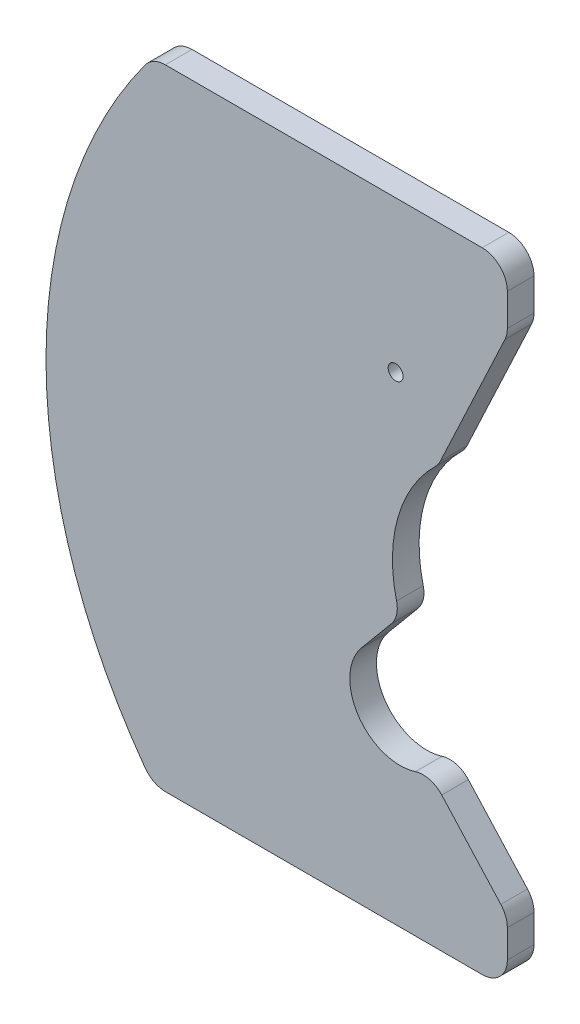
ISO-10303-21;
HEADER;
FILE_DESCRIPTION(('STEP AP214'),'2;1');
FILE_NAME('part.step','',(''),(''),'','','');
FILE_SCHEMA(('AUTOMOTIVE_DESIGN { 1 0 10303 214 1 1 1 1 }'));
ENDSEC;
DATA;
#1=APPLICATION_CONTEXT('core data for automotive mechanical design processes');
#2=APPLICATION_PROTOCOL_DEFINITION('international standard','automotive_design',2000,#1);
#3=PRODUCT_CONTEXT('',#1,'mechanical');
#4=PRODUCT('Part','Part','',(#3));
#5=PRODUCT_RELATED_PRODUCT_CATEGORY('part','',(#4));
#6=PRODUCT_DEFINITION_FORMATION('','',#4);
#7=PRODUCT_DEFINITION_CONTEXT('part definition',#1,'design');
#8=PRODUCT_DEFINITION('design','',#6,#7);
#9=PRODUCT_DEFINITION_SHAPE('','',#8);
#10=(LENGTH_UNIT() NAMED_UNIT(*) SI_UNIT(.MILLI.,.METRE.));
#11=(NAMED_UNIT(*) PLANE_ANGLE_UNIT() SI_UNIT($,.RADIAN.));
#12=(NAMED_UNIT(*) SI_UNIT($,.STERADIAN.) SOLID_ANGLE_UNIT());
#13=UNCERTAINTY_MEASURE_WITH_UNIT(LENGTH_MEASURE(1.E-05),#10,'distance_accuracy_value','');
#14=(GEOMETRIC_REPRESENTATION_CONTEXT(3) GLOBAL_UNCERTAINTY_ASSIGNED_CONTEXT((#13)) GLOBAL_UNIT_ASSIGNED_CONTEXT((#10,
#11,#12)) REPRESENTATION_CONTEXT('',''));
#15=CARTESIAN_POINT('',(0.,0.,0.));
#16=DIRECTION('',(0.,0.,1.));
#17=DIRECTION('',(1.,0.,0.));
#18=AXIS2_PLACEMENT_3D('',#15,#16,#17);
#19=CARTESIAN_POINT('',(-27.9109343849263,-14.8218969791937,3.175));
#20=DIRECTION('',(0.,0.,-1.));
#21=DIRECTION('',(-1.,0.,0.));
#22=AXIS2_PLACEMENT_3D('',#19,#20,#21);
#23=CYLINDRICAL_SURFACE('',#22,6.);
#24=CARTESIAN_POINT('',(-27.9109343849263,-14.8218969791937,3.175));
#25=DIRECTION('',(0.,0.,1.));
#26=DIRECTION('',(1.,0.,0.));
#27=AXIS2_PLACEMENT_3D('',#24,#25,#26);
#28=CIRCLE('',#27,6.);
#29=CARTESIAN_POINT('',(-32.5191536273032,-10.979460849056,3.175));
#30=VERTEX_POINT('',#29);
#31=CARTESIAN_POINT('',(-26.087536255912,-20.5381211930526,3.175));
#32=VERTEX_POINT('',#31);
#33=EDGE_CURVE('E186',#30,#32,#28,.T.);
#34=ORIENTED_EDGE('',*,*,#33,.T.);
#35=DIRECTION('',(0.,0.,-1.));
#36=VECTOR('',#35,1.);
#37=CARTESIAN_POINT('',(-26.087536255912,-20.5381211930526,3.175));
#38=LINE('',#37,#36);
#39=CARTESIAN_POINT('',(-26.087536255912,-20.5381211930526,0.));
#40=VERTEX_POINT('',#39);
#41=EDGE_CURVE('E318',#32,#40,#38,.T.);
#42=ORIENTED_EDGE('',*,*,#41,.T.);
#43=CARTESIAN_POINT('',(-27.9109343849263,-14.8218969791937,0.));
#44=DIRECTION('',(0.,0.,1.));
#45=DIRECTION('',(1.,0.,0.));
#46=AXIS2_PLACEMENT_3D('',#43,#44,#45);
#47=CIRCLE('',#46,6.);
#48=CARTESIAN_POINT('',(-32.5191536273032,-10.979460849056,0.));
#49=VERTEX_POINT('',#48);
#50=EDGE_CURVE('E193',#49,#40,#47,.T.);
#51=ORIENTED_EDGE('',*,*,#50,.F.);
#52=DIRECTION('',(0.,0.,-1.));
#53=VECTOR('',#52,1.);
#54=CARTESIAN_POINT('',(-32.5191536273032,-10.979460849056,3.175));
#55=LINE('',#54,#53);
#56=EDGE_CURVE('E179',#30,#49,#55,.T.);
#57=ORIENTED_EDGE('',*,*,#56,.F.);
#58=EDGE_LOOP('',(#34,#42,#51,#57));
#59=FACE_BOUND('',#58,.T.);
#60=ADVANCED_FACE('F42',(#59),#23,.F.);
#61=CARTESIAN_POINT('',(-13.7820972939783,11.4918205506516,3.175));
#62=DIRECTION('',(0.768036540396148,-0.640406021689612,0.));
#63=DIRECTION('',(0.640406021689612,0.768036540396148,0.));
#64=AXIS2_PLACEMENT_3D('',#61,#62,#63);
#65=PLANE('',#64);
#66=DIRECTION('',(-0.640406021689612,-0.768036540396148,0.));
#67=VECTOR('',#66,1.);
#68=CARTESIAN_POINT('',(-13.7820972939783,11.4918205506516,0.));
#69=LINE('',#68,#67);
#70=CARTESIAN_POINT('',(-28.9443574532879,-6.69222120245133,0.));
#71=VERTEX_POINT('',#70);
#72=EDGE_CURVE('E231',#71,#49,#69,.T.);
#73=ORIENTED_EDGE('',*,*,#72,.F.);
#74=DIRECTION('',(0.,0.,-1.));
#75=VECTOR('',#74,1.);
#76=CARTESIAN_POINT('',(-28.9443574532879,-6.69222120245133,3.175));
#77=LINE('',#76,#75);
#78=CARTESIAN_POINT('',(-28.9443574532879,-6.69222120245133,3.175));
#79=VERTEX_POINT('',#78);
#80=EDGE_CURVE('E182',#71,#79,#77,.F.);
#81=ORIENTED_EDGE('',*,*,#80,.T.);
#82=DIRECTION('',(-0.640406021689612,-0.768036540396148,0.));
#83=VECTOR('',#82,1.);
#84=CARTESIAN_POINT('',(-13.7820972939783,11.4918205506516,3.175));
#85=LINE('',#84,#83);
#86=EDGE_CURVE('E175',#79,#30,#85,.T.);
#87=ORIENTED_EDGE('',*,*,#86,.T.);
#88=ORIENTED_EDGE('',*,*,#56,.T.);
#89=EDGE_LOOP('',(#73,#81,#87,#88));
#90=FACE_BOUND('',#89,.T.);
#91=ADVANCED_FACE('F178',(#90),#65,.T.);
#92=CARTESIAN_POINT('',(-11.8361609501879,-1.46179927366587E-13,3.175));
#93=DIRECTION('',(0.,0.,-1.));
#94=DIRECTION('',(-1.,0.,0.));
#95=AXIS2_PLACEMENT_3D('',#92,#93,#94);
#96=CYLINDRICAL_SURFACE('',#95,16.99);
#97=CARTESIAN_POINT('',(-11.8361609501879,-1.46179927366587E-13,3.175));
#98=DIRECTION('',(0.,0.,1.));
#99=DIRECTION('',(1.,0.,0.));
#100=AXIS2_PLACEMENT_3D('',#97,#98,#99);
#101=CIRCLE('',#100,16.99);
#102=CARTESIAN_POINT('',(-23.7297180454384,12.1327408124468,3.175));
#103=VERTEX_POINT('',#102);
#104=CARTESIAN_POINT('',(-28.3351645045481,-4.05499466253772,3.175));
#105=VERTEX_POINT('',#104);
#106=EDGE_CURVE('E185',#103,#105,#101,.T.);
#107=ORIENTED_EDGE('',*,*,#106,.T.);
#108=DIRECTION('',(0.,0.,-1.));
#109=VECTOR('',#108,1.);
#110=CARTESIAN_POINT('',(-28.3351645045481,-4.05499466253772,3.175));
#111=LINE('',#110,#109);
#112=CARTESIAN_POINT('',(-28.3351645045481,-4.05499466253772,0.));
#113=VERTEX_POINT('',#112);
#114=EDGE_CURVE('E322',#105,#113,#111,.T.);
#115=ORIENTED_EDGE('',*,*,#114,.T.);
#116=CARTESIAN_POINT('',(-11.8361609501879,-1.46179927366587E-13,0.));
#117=DIRECTION('',(0.,0.,1.));
#118=DIRECTION('',(1.,0.,0.));
#119=AXIS2_PLACEMENT_3D('',#116,#117,#118);
#120=CIRCLE('',#119,16.99);
#121=CARTESIAN_POINT('',(-23.7297180454384,12.1327408124468,0.));
#122=VERTEX_POINT('',#121);
#123=EDGE_CURVE('E233',#122,#113,#120,.T.);
#124=ORIENTED_EDGE('',*,*,#123,.F.);
#125=DIRECTION('',(0.,0.,-1.));
#126=VECTOR('',#125,1.);
#127=CARTESIAN_POINT('',(-23.7297180454384,12.1327408124468,3.175));
#128=LINE('',#127,#126);
#129=EDGE_CURVE('E320',#122,#103,#128,.F.);
#130=ORIENTED_EDGE('',*,*,#129,.T.);
#131=EDGE_LOOP('',(#107,#115,#124,#130));
#132=FACE_BOUND('',#131,.T.);
#133=ADVANCED_FACE('F390',(#132),#96,.F.);
#134=CARTESIAN_POINT('',(-23.9426449498322,11.2346092179196,3.175));
#135=DIRECTION('',(0.905291840841544,-0.424790163381556,0.));
#136=DIRECTION('',(0.424790163381556,0.905291840841544,0.));
#137=AXIS2_PLACEMENT_3D('',#134,#135,#136);
#138=PLANE('',#137);
#139=DIRECTION('',(-0.424790163381556,-0.905291840841544,0.));
#140=VECTOR('',#139,1.);
#141=CARTESIAN_POINT('',(-23.9426449498322,11.2346092179196,3.175));
#142=LINE('',#141,#140);
#143=CARTESIAN_POINT('',(-15.4214835994482,29.3944879297716,3.175));
#144=VERTEX_POINT('',#143);
#145=CARTESIAN_POINT('',(-23.1139408917044,13.0007024257359,3.175));
#146=VERTEX_POINT('',#145);
#147=EDGE_CURVE('E211',#144,#146,#142,.T.);
#148=ORIENTED_EDGE('',*,*,#147,.T.);
#149=DIRECTION('',(0.,0.,-1.));
#150=VECTOR('',#149,1.);
#151=CARTESIAN_POINT('',(-23.1139408917044,13.0007024257359,3.175));
#152=LINE('',#151,#150);
#153=CARTESIAN_POINT('',(-23.1139408917044,13.0007024257359,0.));
#154=VERTEX_POINT('',#153);
#155=EDGE_CURVE('E11',#146,#154,#152,.T.);
#156=ORIENTED_EDGE('',*,*,#155,.T.);
#157=DIRECTION('',(-0.424790163381556,-0.905291840841544,0.));
#158=VECTOR('',#157,1.);
#159=CARTESIAN_POINT('',(-23.9426449498322,11.2346092179196,0.));
#160=LINE('',#159,#158);
#161=CARTESIAN_POINT('',(-15.4214835994482,29.3944879297716,0.));
#162=VERTEX_POINT('',#161);
#163=EDGE_CURVE('E236',#162,#154,#160,.T.);
#164=ORIENTED_EDGE('',*,*,#163,.F.);
#165=DIRECTION('',(0.,0.,-1.));
#166=VECTOR('',#165,1.);
#167=CARTESIAN_POINT('',(-15.4214835994482,29.3944879297716,3.175));
#168=LINE('',#167,#166);
#169=EDGE_CURVE('E50',#162,#144,#168,.F.);
#170=ORIENTED_EDGE('',*,*,#169,.T.);
#171=EDGE_LOOP('',(#148,#156,#164,#170));
#172=FACE_BOUND('',#171,.T.);
#173=ADVANCED_FACE('F329',(#172),#138,.T.);
#174=CARTESIAN_POINT('',(-15.1373591219729,0.,3.175));
#175=DIRECTION('',(1.,0.,0.));
#176=DIRECTION('',(0.,1.,0.));
#177=AXIS2_PLACEMENT_3D('',#174,#175,#176);
#178=PLANE('',#177);
#179=DIRECTION('',(0.,-1.,0.));
#180=VECTOR('',#179,1.);
#181=CARTESIAN_POINT('',(-15.1373591219729,0.,0.));
#182=LINE('',#181,#180);
#183=CARTESIAN_POINT('',(-15.1373591219729,34.5,0.));
#184=VERTEX_POINT('',#183);
#185=CARTESIAN_POINT('',(-15.1373591219729,30.6688584199163,0.));
#186=VERTEX_POINT('',#185);
#187=EDGE_CURVE('E239',#184,#186,#182,.T.);
#188=ORIENTED_EDGE('',*,*,#187,.F.);
#189=DIRECTION('',(0.,0.,-1.));
#190=VECTOR('',#189,1.);
#191=CARTESIAN_POINT('',(-15.1373591219729,34.5,3.175));
#192=LINE('',#191,#190);
#193=CARTESIAN_POINT('',(-15.1373591219729,34.5,3.175));
#194=VERTEX_POINT('',#193);
#195=EDGE_CURVE('E307',#184,#194,#192,.F.);
#196=ORIENTED_EDGE('',*,*,#195,.T.);
#197=DIRECTION('',(0.,-1.,0.));
#198=VECTOR('',#197,1.);
#199=CARTESIAN_POINT('',(-15.1373591219729,0.,3.175));
#200=LINE('',#199,#198);
#201=CARTESIAN_POINT('',(-15.1373591219729,30.6688584199163,3.175));
#202=VERTEX_POINT('',#201);
#203=EDGE_CURVE('E214',#194,#202,#200,.T.);
#204=ORIENTED_EDGE('',*,*,#203,.T.);
#205=DIRECTION('',(0.,0.,-1.));
#206=VECTOR('',#205,1.);
#207=CARTESIAN_POINT('',(-15.1373591219729,30.6688584199163,3.175));
#208=LINE('',#207,#206);
#209=EDGE_CURVE('E304',#202,#186,#208,.T.);
#210=ORIENTED_EDGE('',*,*,#209,.T.);
#211=EDGE_LOOP('',(#188,#196,#204,#210));
#212=FACE_BOUND('',#211,.T.);
#213=ADVANCED_FACE('F339',(#212),#178,.T.);
#214=CARTESIAN_POINT('',(0.,37.5,3.175));
#215=DIRECTION('',(0.,1.,0.));
#216=DIRECTION('',(0.,0.,1.));
#217=AXIS2_PLACEMENT_3D('',#214,#215,#216);
#218=PLANE('',#217);
#219=DIRECTION('',(1.,0.,0.));
#220=VECTOR('',#219,1.);
#221=CARTESIAN_POINT('',(0.,37.5,3.175));
#222=LINE('',#221,#220);
#223=CARTESIAN_POINT('',(-55.8842337214882,37.5,3.175));
#224=VERTEX_POINT('',#223);
#225=CARTESIAN_POINT('',(-18.1373591219729,37.5,3.175));
#226=VERTEX_POINT('',#225);
#227=EDGE_CURVE('E217',#224,#226,#222,.T.);
#228=ORIENTED_EDGE('',*,*,#227,.T.);
#229=DIRECTION('',(0.,0.,-1.));
#230=VECTOR('',#229,1.);
#231=CARTESIAN_POINT('',(-18.1373591219729,37.5,3.175));
#232=LINE('',#231,#230);
#233=CARTESIAN_POINT('',(-18.1373591219729,37.5,0.));
#234=VERTEX_POINT('',#233);
#235=EDGE_CURVE('E301',#226,#234,#232,.T.);
#236=ORIENTED_EDGE('',*,*,#235,.T.);
#237=DIRECTION('',(1.,0.,0.));
#238=VECTOR('',#237,1.);
#239=CARTESIAN_POINT('',(0.,37.5,0.));
#240=LINE('',#239,#238);
#241=CARTESIAN_POINT('',(-55.8842337214882,37.5,0.));
#242=VERTEX_POINT('',#241);
#243=EDGE_CURVE('E242',#242,#234,#240,.T.);
#244=ORIENTED_EDGE('',*,*,#243,.F.);
#245=DIRECTION('',(0.,0.,1.));
#246=VECTOR('',#245,1.);
#247=CARTESIAN_POINT('',(-55.8842337214882,37.5,3.175));
#248=LINE('',#247,#246);
#249=EDGE_CURVE('E299',#242,#224,#248,.T.);
#250=ORIENTED_EDGE('',*,*,#249,.T.);
#251=EDGE_LOOP('',(#228,#236,#244,#250));
#252=FACE_BOUND('',#251,.T.);
#253=ADVANCED_FACE('F351',(#252),#218,.T.);
#254=CARTESIAN_POINT('',(-8.50916704218404,0.0184530200357561,3.175));
#255=DIRECTION('',(0.,0.,-1.));
#256=DIRECTION('',(-1.,0.,0.));
#257=AXIS2_PLACEMENT_3D('',#254,#255,#256);
#258=CYLINDRICAL_SURFACE('',#257,61.595);
#259=CARTESIAN_POINT('',(-8.50916704218404,0.0184530200357561,3.175));
#260=DIRECTION('',(0.,0.,1.));
#261=DIRECTION('',(1.,0.,0.));
#262=AXIS2_PLACEMENT_3D('',#259,#260,#261);
#263=CIRCLE('',#262,61.595);
#264=CARTESIAN_POINT('',(-58.3097853903663,36.2654175431332,3.175));
#265=VERTEX_POINT('',#264);
#266=CARTESIAN_POINT('',(-58.2815252150332,-36.2673070920745,3.175));
#267=VERTEX_POINT('',#266);
#268=EDGE_CURVE('E220',#265,#267,#263,.T.);
#269=ORIENTED_EDGE('',*,*,#268,.F.);
#270=DIRECTION('',(0.,0.,-1.));
#271=VECTOR('',#270,1.);
#272=CARTESIAN_POINT('',(-58.3097853903663,36.2654175431332,3.175));
#273=LINE('',#272,#271);
#274=CARTESIAN_POINT('',(-58.3097853903663,36.2654175431332,0.));
#275=VERTEX_POINT('',#274);
#276=EDGE_CURVE('E311',#265,#275,#273,.T.);
#277=ORIENTED_EDGE('',*,*,#276,.T.);
#278=CARTESIAN_POINT('',(-8.50916704218404,0.0184530200357561,0.));
#279=DIRECTION('',(0.,0.,1.));
#280=DIRECTION('',(1.,0.,0.));
#281=AXIS2_PLACEMENT_3D('',#278,#279,#280);
#282=CIRCLE('',#281,61.595);
#283=CARTESIAN_POINT('',(-58.2815252150332,-36.2673070920745,0.));
#284=VERTEX_POINT('',#283);
#285=EDGE_CURVE('E245',#275,#284,#282,.T.);
#286=ORIENTED_EDGE('',*,*,#285,.T.);
#287=DIRECTION('',(0.,0.,-1.));
#288=VECTOR('',#287,1.);
#289=CARTESIAN_POINT('',(-58.2815252150332,-36.2673070920745,3.175));
#290=LINE('',#289,#288);
#291=EDGE_CURVE('E309',#284,#267,#290,.F.);
#292=ORIENTED_EDGE('',*,*,#291,.T.);
#293=EDGE_LOOP('',(#269,#277,#286,#292));
#294=FACE_BOUND('',#293,.T.);
#295=ADVANCED_FACE('F361',(#294),#258,.T.);
#296=CARTESIAN_POINT('',(0.,-37.5,3.175));
#297=DIRECTION('',(0.,-1.,0.));
#298=DIRECTION('',(1.,0.,0.));
#299=AXIS2_PLACEMENT_3D('',#296,#297,#298);
#300=PLANE('',#299);
#301=DIRECTION('',(-1.,0.,0.));
#302=VECTOR('',#301,1.);
#303=CARTESIAN_POINT('',(0.,-37.5,3.175));
#304=LINE('',#303,#302);
#305=CARTESIAN_POINT('',(-18.1373591219729,-37.5,3.175));
#306=VERTEX_POINT('',#305);
#307=CARTESIAN_POINT('',(-55.8573499651177,-37.5,3.175));
#308=VERTEX_POINT('',#307);
#309=EDGE_CURVE('E222',#306,#308,#304,.T.);
#310=ORIENTED_EDGE('',*,*,#309,.T.);
#311=DIRECTION('',(0.,0.,1.));
#312=VECTOR('',#311,1.);
#313=CARTESIAN_POINT('',(-55.8573499651177,-37.5,0.));
#314=LINE('',#313,#312);
#315=CARTESIAN_POINT('',(-55.8573499651177,-37.5,0.));
#316=VERTEX_POINT('',#315);
#317=EDGE_CURVE('E315',#308,#316,#314,.F.);
#318=ORIENTED_EDGE('',*,*,#317,.T.);
#319=DIRECTION('',(-1.,0.,0.));
#320=VECTOR('',#319,1.);
#321=CARTESIAN_POINT('',(0.,-37.5,0.));
#322=LINE('',#321,#320);
#323=CARTESIAN_POINT('',(-18.1373591219729,-37.5,0.));
#324=VERTEX_POINT('',#323);
#325=EDGE_CURVE('E248',#324,#316,#322,.T.);
#326=ORIENTED_EDGE('',*,*,#325,.F.);
#327=DIRECTION('',(0.,0.,-1.));
#328=VECTOR('',#327,1.);
#329=CARTESIAN_POINT('',(-18.1373591219729,-37.5,3.175));
#330=LINE('',#329,#328);
#331=EDGE_CURVE('E64',#324,#306,#330,.F.);
#332=ORIENTED_EDGE('',*,*,#331,.T.);
#333=EDGE_LOOP('',(#310,#318,#326,#332));
#334=FACE_BOUND('',#333,.T.);
#335=ADVANCED_FACE('F366',(#334),#300,.T.);
#336=CARTESIAN_POINT('',(-15.1373591219729,0.,3.175));
#337=DIRECTION('',(-1.,0.,0.));
#338=DIRECTION('',(0.,0.,1.));
#339=AXIS2_PLACEMENT_3D('',#336,#337,#338);
#340=PLANE('',#339);
#341=DIRECTION('',(0.,1.,0.));
#342=VECTOR('',#341,1.);
#343=CARTESIAN_POINT('',(-15.1373591219729,0.,0.));
#344=LINE('',#343,#342);
#345=CARTESIAN_POINT('',(-15.1373591219729,-34.5,0.));
#346=VERTEX_POINT('',#345);
#347=CARTESIAN_POINT('',(-15.1373591219729,-31.1577021003351,0.));
#348=VERTEX_POINT('',#347);
#349=EDGE_CURVE('E251',#346,#348,#344,.T.);
#350=ORIENTED_EDGE('',*,*,#349,.T.);
#351=DIRECTION('',(0.,0.,-1.));
#352=VECTOR('',#351,1.);
#353=CARTESIAN_POINT('',(-15.1373591219729,-31.1577021003351,3.175));
#354=LINE('',#353,#352);
#355=CARTESIAN_POINT('',(-15.1373591219729,-31.1577021003351,3.175));
#356=VERTEX_POINT('',#355);
#357=EDGE_CURVE('E281',#348,#356,#354,.F.);
#358=ORIENTED_EDGE('',*,*,#357,.T.);
#359=DIRECTION('',(0.,1.,0.));
#360=VECTOR('',#359,1.);
#361=CARTESIAN_POINT('',(-15.1373591219729,0.,3.175));
#362=LINE('',#361,#360);
#363=CARTESIAN_POINT('',(-15.1373591219729,-34.5,3.175));
#364=VERTEX_POINT('',#363);
#365=EDGE_CURVE('E224',#364,#356,#362,.T.);
#366=ORIENTED_EDGE('',*,*,#365,.F.);
#367=DIRECTION('',(0.,0.,-1.));
#368=VECTOR('',#367,1.);
#369=CARTESIAN_POINT('',(-15.1373591219729,-34.5,0.));
#370=LINE('',#369,#368);
#371=EDGE_CURVE('E278',#364,#346,#370,.T.);
#372=ORIENTED_EDGE('',*,*,#371,.T.);
#373=EDGE_LOOP('',(#350,#358,#366,#372));
#374=FACE_BOUND('',#373,.T.);
#375=ADVANCED_FACE('F374',(#374),#340,.F.);
#376=CARTESIAN_POINT('',(-23.2349708256036,-21.0706036198285,3.175));
#377=DIRECTION('',(-0.740766224710615,-0.67176290484663,0.));
#378=DIRECTION('',(0.67176290484663,-0.740766224710615,0.));
#379=AXIS2_PLACEMENT_3D('',#376,#377,#378);
#380=PLANE('',#379);
#381=DIRECTION('',(-0.67176290484663,0.740766224710615,0.));
#382=VECTOR('',#381,1.);
#383=CARTESIAN_POINT('',(-23.2349708256036,-21.0706036198285,3.175));
#384=LINE('',#383,#382);
#385=CARTESIAN_POINT('',(-15.915060447841,-29.1424133857952,3.175));
#386=VERTEX_POINT('',#385);
#387=CARTESIAN_POINT('',(-22.953538517273,-21.3809445854422,3.175));
#388=VERTEX_POINT('',#387);
#389=EDGE_CURVE('E226',#386,#388,#384,.T.);
#390=ORIENTED_EDGE('',*,*,#389,.F.);
#391=DIRECTION('',(0.,0.,-1.));
#392=VECTOR('',#391,1.);
#393=CARTESIAN_POINT('',(-15.915060447841,-29.1424133857952,3.175));
#394=LINE('',#393,#392);
#395=CARTESIAN_POINT('',(-15.915060447841,-29.1424133857952,0.));
#396=VERTEX_POINT('',#395);
#397=EDGE_CURVE('E257',#386,#396,#394,.T.);
#398=ORIENTED_EDGE('',*,*,#397,.T.);
#399=DIRECTION('',(-0.67176290484663,0.740766224710615,0.));
#400=VECTOR('',#399,1.);
#401=CARTESIAN_POINT('',(-23.2349708256036,-21.0706036198285,0.));
#402=LINE('',#401,#400);
#403=CARTESIAN_POINT('',(-22.953538517273,-21.3809445854422,0.));
#404=VERTEX_POINT('',#403);
#405=EDGE_CURVE('E206',#396,#404,#402,.T.);
#406=ORIENTED_EDGE('',*,*,#405,.T.);
#407=DIRECTION('',(0.,0.,1.));
#408=VECTOR('',#407,1.);
#409=CARTESIAN_POINT('',(-22.953538517273,-21.3809445854422,3.175));
#410=LINE('',#409,#408);
#411=EDGE_CURVE('E194',#404,#388,#410,.T.);
#412=ORIENTED_EDGE('',*,*,#411,.T.);
#413=EDGE_LOOP('',(#390,#398,#406,#412));
#414=FACE_BOUND('',#413,.T.);
#415=ADVANCED_FACE('F382',(#414),#380,.F.);
#416=CARTESIAN_POINT('',(-28.4483230115573,19.5,3.175));
#417=DIRECTION('',(0.,0.,-1.));
#418=DIRECTION('',(-1.,0.,0.));
#419=AXIS2_PLACEMENT_3D('',#416,#417,#418);
#420=CYLINDRICAL_SURFACE('',#419,0.889);
#421=CARTESIAN_POINT('',(-28.4483230115573,19.5,3.175));
#422=DIRECTION('',(0.,0.,1.));
#423=DIRECTION('',(1.,0.,0.));
#424=AXIS2_PLACEMENT_3D('',#421,#422,#423);
#425=CIRCLE('',#424,0.889);
#426=CARTESIAN_POINT('',(-27.5593230115573,19.5,3.175));
#427=VERTEX_POINT('',#426);
#428=EDGE_CURVE('E195',#427,#427,#425,.T.);
#429=ORIENTED_EDGE('',*,*,#428,.T.);
#430=EDGE_LOOP('',(#429));
#431=FACE_BOUND('',#430,.T.);
#432=CARTESIAN_POINT('',(-28.4483230115573,19.5,0.));
#433=DIRECTION('',(0.,0.,1.));
#434=DIRECTION('',(1.,0.,0.));
#435=AXIS2_PLACEMENT_3D('',#432,#433,#434);
#436=CIRCLE('',#435,0.889);
#437=CARTESIAN_POINT('',(-27.5593230115573,19.5,0.));
#438=VERTEX_POINT('',#437);
#439=EDGE_CURVE('E203',#438,#438,#436,.T.);
#440=ORIENTED_EDGE('',*,*,#439,.F.);
#441=EDGE_LOOP('',(#440));
#442=FACE_BOUND('',#441,.T.);
#443=ADVANCED_FACE('F494',(#431,#442),#420,.F.);
#444=CARTESIAN_POINT('',(0.,0.,3.175));
#445=DIRECTION('',(0.,0.,1.));
#446=DIRECTION('',(1.,0.,0.));
#447=AXIS2_PLACEMENT_3D('',#444,#445,#446);
#448=PLANE('',#447);
#449=ORIENTED_EDGE('',*,*,#365,.T.);
#450=CARTESIAN_POINT('',(-18.1373591219729,-31.1577021003351,3.175));
#451=DIRECTION('',(0.,0.,1.));
#452=DIRECTION('',(1.,0.,0.));
#453=AXIS2_PLACEMENT_3D('',#450,#451,#452);
#454=CIRCLE('',#453,3.);
#455=EDGE_CURVE('E297',#356,#386,#454,.T.);
#456=ORIENTED_EDGE('',*,*,#455,.T.);
#457=ORIENTED_EDGE('',*,*,#389,.T.);
#458=CARTESIAN_POINT('',(-25.1758371914049,-23.3962332999821,3.175));
#459=DIRECTION('',(0.,0.,1.));
#460=DIRECTION('',(1.,0.,0.));
#461=AXIS2_PLACEMENT_3D('',#458,#459,#460);
#462=CIRCLE('',#461,3.);
#463=EDGE_CURVE('E202',#388,#32,#462,.T.);
#464=ORIENTED_EDGE('',*,*,#463,.T.);
#465=ORIENTED_EDGE('',*,*,#33,.F.);
#466=ORIENTED_EDGE('',*,*,#86,.F.);
#467=CARTESIAN_POINT('',(-31.2484670744763,-4.77100313738249,3.175));
#468=DIRECTION('',(0.,0.,1.));
#469=DIRECTION('',(1.,0.,0.));
#470=AXIS2_PLACEMENT_3D('',#467,#468,#469);
#471=CIRCLE('',#470,3.);
#472=EDGE_CURVE('E287',#79,#105,#471,.T.);
#473=ORIENTED_EDGE('',*,*,#472,.T.);
#474=ORIENTED_EDGE('',*,*,#106,.F.);
#475=CARTESIAN_POINT('',(-25.829816414229,14.2750729158806,3.175));
#476=DIRECTION('',(0.,0.,1.));
#477=DIRECTION('',(1.,0.,0.));
#478=AXIS2_PLACEMENT_3D('',#475,#476,#477);
#479=CIRCLE('',#478,3.);
#480=EDGE_CURVE('E285',#103,#146,#479,.T.);
#481=ORIENTED_EDGE('',*,*,#480,.T.);
#482=ORIENTED_EDGE('',*,*,#147,.F.);
#483=CARTESIAN_POINT('',(-18.1373591219729,30.6688584199163,3.175));
#484=DIRECTION('',(0.,0.,1.));
#485=DIRECTION('',(1.,0.,0.));
#486=AXIS2_PLACEMENT_3D('',#483,#484,#485);
#487=CIRCLE('',#486,3.);
#488=EDGE_CURVE('E283',#144,#202,#487,.T.);
#489=ORIENTED_EDGE('',*,*,#488,.T.);
#490=ORIENTED_EDGE('',*,*,#203,.F.);
#491=CARTESIAN_POINT('',(-18.1373591219729,34.5,3.175));
#492=DIRECTION('',(0.,0.,1.));
#493=DIRECTION('',(1.,0.,0.));
#494=AXIS2_PLACEMENT_3D('',#491,#492,#493);
#495=CIRCLE('',#494,3.);
#496=EDGE_CURVE('E295',#194,#226,#495,.T.);
#497=ORIENTED_EDGE('',*,*,#496,.T.);
#498=ORIENTED_EDGE('',*,*,#227,.F.);
#499=CARTESIAN_POINT('',(-55.8842337214882,34.5,3.175));
#500=DIRECTION('',(0.,0.,1.));
#501=DIRECTION('',(1.,0.,0.));
#502=AXIS2_PLACEMENT_3D('',#499,#500,#501);
#503=CIRCLE('',#502,3.);
#504=EDGE_CURVE('E293',#224,#265,#503,.T.);
#505=ORIENTED_EDGE('',*,*,#504,.T.);
#506=ORIENTED_EDGE('',*,*,#268,.T.);
#507=CARTESIAN_POINT('',(-55.8573499651177,-34.5,3.175));
#508=DIRECTION('',(0.,0.,1.));
#509=DIRECTION('',(1.,0.,0.));
#510=AXIS2_PLACEMENT_3D('',#507,#508,#509);
#511=CIRCLE('',#510,3.);
#512=EDGE_CURVE('E57',#267,#308,#511,.T.);
#513=ORIENTED_EDGE('',*,*,#512,.T.);
#514=ORIENTED_EDGE('',*,*,#309,.F.);
#515=CARTESIAN_POINT('',(-18.1373591219729,-34.5,3.175));
#516=DIRECTION('',(0.,0.,1.));
#517=DIRECTION('',(1.,0.,0.));
#518=AXIS2_PLACEMENT_3D('',#515,#516,#517);
#519=CIRCLE('',#518,3.);
#520=EDGE_CURVE('E290',#306,#364,#519,.T.);
#521=ORIENTED_EDGE('',*,*,#520,.T.);
#522=EDGE_LOOP('',(#449,#456,#457,#464,#465,#466,#473,#474,#481,#482,#489,#490,#497,#498,#505,
#506,#513,#514,#521));
#523=FACE_BOUND('',#522,.T.);
#524=ORIENTED_EDGE('',*,*,#428,.F.);
#525=EDGE_LOOP('',(#524));
#526=FACE_BOUND('',#525,.T.);
#527=ADVANCED_FACE('F198',(#523,#526),#448,.T.);
#528=CARTESIAN_POINT('',(0.,0.,0.));
#529=DIRECTION('',(0.,0.,1.));
#530=DIRECTION('',(1.,0.,0.));
#531=AXIS2_PLACEMENT_3D('',#528,#529,#530);
#532=PLANE('',#531);
#533=ORIENTED_EDGE('',*,*,#405,.F.);
#534=CARTESIAN_POINT('',(-18.1373591219729,-31.1577021003351,0.));
#535=DIRECTION('',(0.,0.,1.));
#536=DIRECTION('',(1.,0.,0.));
#537=AXIS2_PLACEMENT_3D('',#534,#535,#536);
#538=CIRCLE('',#537,3.);
#539=EDGE_CURVE('E276',#396,#348,#538,.F.);
#540=ORIENTED_EDGE('',*,*,#539,.T.);
#541=ORIENTED_EDGE('',*,*,#349,.F.);
#542=CARTESIAN_POINT('',(-18.1373591219729,-34.5,0.));
#543=DIRECTION('',(0.,0.,1.));
#544=DIRECTION('',(1.,0.,0.));
#545=AXIS2_PLACEMENT_3D('',#542,#543,#544);
#546=CIRCLE('',#545,3.);
#547=EDGE_CURVE('E268',#346,#324,#546,.F.);
#548=ORIENTED_EDGE('',*,*,#547,.T.);
#549=ORIENTED_EDGE('',*,*,#325,.T.);
#550=CARTESIAN_POINT('',(-55.8573499651177,-34.5,0.));
#551=DIRECTION('',(0.,0.,1.));
#552=DIRECTION('',(1.,0.,0.));
#553=AXIS2_PLACEMENT_3D('',#550,#551,#552);
#554=CIRCLE('',#553,3.);
#555=EDGE_CURVE('E270',#316,#284,#554,.F.);
#556=ORIENTED_EDGE('',*,*,#555,.T.);
#557=ORIENTED_EDGE('',*,*,#285,.F.);
#558=CARTESIAN_POINT('',(-55.8842337214882,34.5,0.));
#559=DIRECTION('',(0.,0.,1.));
#560=DIRECTION('',(1.,0.,0.));
#561=AXIS2_PLACEMENT_3D('',#558,#559,#560);
#562=CIRCLE('',#561,3.);
#563=EDGE_CURVE('E272',#275,#242,#562,.F.);
#564=ORIENTED_EDGE('',*,*,#563,.T.);
#565=ORIENTED_EDGE('',*,*,#243,.T.);
#566=CARTESIAN_POINT('',(-18.1373591219729,34.5,0.));
#567=DIRECTION('',(0.,0.,1.));
#568=DIRECTION('',(1.,0.,0.));
#569=AXIS2_PLACEMENT_3D('',#566,#567,#568);
#570=CIRCLE('',#569,3.);
#571=EDGE_CURVE('E274',#234,#184,#570,.F.);
#572=ORIENTED_EDGE('',*,*,#571,.T.);
#573=ORIENTED_EDGE('',*,*,#187,.T.);
#574=CARTESIAN_POINT('',(-18.1373591219729,30.6688584199163,0.));
#575=DIRECTION('',(0.,0.,1.));
#576=DIRECTION('',(1.,0.,0.));
#577=AXIS2_PLACEMENT_3D('',#574,#575,#576);
#578=CIRCLE('',#577,3.);
#579=EDGE_CURVE('E260',#186,#162,#578,.F.);
#580=ORIENTED_EDGE('',*,*,#579,.T.);
#581=ORIENTED_EDGE('',*,*,#163,.T.);
#582=CARTESIAN_POINT('',(-25.829816414229,14.2750729158806,0.));
#583=DIRECTION('',(0.,0.,1.));
#584=DIRECTION('',(1.,0.,0.));
#585=AXIS2_PLACEMENT_3D('',#582,#583,#584);
#586=CIRCLE('',#585,3.);
#587=EDGE_CURVE('E262',#154,#122,#586,.F.);
#588=ORIENTED_EDGE('',*,*,#587,.T.);
#589=ORIENTED_EDGE('',*,*,#123,.T.);
#590=CARTESIAN_POINT('',(-31.2484670744763,-4.77100313738249,0.));
#591=DIRECTION('',(0.,0.,1.));
#592=DIRECTION('',(1.,0.,0.));
#593=AXIS2_PLACEMENT_3D('',#590,#591,#592);
#594=CIRCLE('',#593,3.);
#595=EDGE_CURVE('E264',#113,#71,#594,.F.);
#596=ORIENTED_EDGE('',*,*,#595,.T.);
#597=ORIENTED_EDGE('',*,*,#72,.T.);
#598=ORIENTED_EDGE('',*,*,#50,.T.);
#599=CARTESIAN_POINT('',(-25.1758371914049,-23.3962332999821,0.));
#600=DIRECTION('',(0.,0.,1.));
#601=DIRECTION('',(1.,0.,0.));
#602=AXIS2_PLACEMENT_3D('',#599,#600,#601);
#603=CIRCLE('',#602,3.);
#604=EDGE_CURVE('E266',#40,#404,#603,.F.);
#605=ORIENTED_EDGE('',*,*,#604,.T.);
#606=EDGE_LOOP('',(#533,#540,#541,#548,#549,#556,#557,#564,#565,#572,#573,#580,#581,#588,#589,
#596,#597,#598,#605));
#607=FACE_BOUND('',#606,.T.);
#608=ORIENTED_EDGE('',*,*,#439,.T.);
#609=EDGE_LOOP('',(#608));
#610=FACE_BOUND('',#609,.T.);
#611=ADVANCED_FACE('F343',(#607,#610),#532,.F.);
#612=CARTESIAN_POINT('',(-18.1373591219729,-31.1577021003351,3.175));
#613=DIRECTION('',(0.,0.,-1.));
#614=DIRECTION('',(-1.,0.,0.));
#615=AXIS2_PLACEMENT_3D('',#612,#613,#614);
#616=CYLINDRICAL_SURFACE('',#615,3.);
#617=ORIENTED_EDGE('',*,*,#455,.F.);
#618=ORIENTED_EDGE('',*,*,#357,.F.);
#619=ORIENTED_EDGE('',*,*,#539,.F.);
#620=ORIENTED_EDGE('',*,*,#397,.F.);
#621=EDGE_LOOP('',(#617,#618,#619,#620));
#622=FACE_BOUND('',#621,.T.);
#623=ADVANCED_FACE('F379',(#622),#616,.T.);
#624=CARTESIAN_POINT('',(-18.1373591219729,34.5,3.175));
#625=DIRECTION('',(0.,0.,-1.));
#626=DIRECTION('',(-1.,0.,0.));
#627=AXIS2_PLACEMENT_3D('',#624,#625,#626);
#628=CYLINDRICAL_SURFACE('',#627,3.);
#629=ORIENTED_EDGE('',*,*,#496,.F.);
#630=ORIENTED_EDGE('',*,*,#195,.F.);
#631=ORIENTED_EDGE('',*,*,#571,.F.);
#632=ORIENTED_EDGE('',*,*,#235,.F.);
#633=EDGE_LOOP('',(#629,#630,#631,#632));
#634=FACE_BOUND('',#633,.T.);
#635=ADVANCED_FACE('F349',(#634),#628,.T.);
#636=CARTESIAN_POINT('',(-55.8842337214882,34.5,3.175));
#637=DIRECTION('',(0.,0.,-1.));
#638=DIRECTION('',(-1.,0.,0.));
#639=AXIS2_PLACEMENT_3D('',#636,#637,#638);
#640=CYLINDRICAL_SURFACE('',#639,3.);
#641=ORIENTED_EDGE('',*,*,#504,.F.);
#642=ORIENTED_EDGE('',*,*,#249,.F.);
#643=ORIENTED_EDGE('',*,*,#563,.F.);
#644=ORIENTED_EDGE('',*,*,#276,.F.);
#645=EDGE_LOOP('',(#641,#642,#643,#644));
#646=FACE_BOUND('',#645,.T.);
#647=ADVANCED_FACE('F358',(#646),#640,.T.);
#648=CARTESIAN_POINT('',(-55.8573499651177,-34.5,3.175));
#649=DIRECTION('',(0.,0.,-1.));
#650=DIRECTION('',(-1.,0.,0.));
#651=AXIS2_PLACEMENT_3D('',#648,#649,#650);
#652=CYLINDRICAL_SURFACE('',#651,3.);
#653=ORIENTED_EDGE('',*,*,#512,.F.);
#654=ORIENTED_EDGE('',*,*,#291,.F.);
#655=ORIENTED_EDGE('',*,*,#555,.F.);
#656=ORIENTED_EDGE('',*,*,#317,.F.);
#657=EDGE_LOOP('',(#653,#654,#655,#656));
#658=FACE_BOUND('',#657,.T.);
#659=ADVANCED_FACE('F365',(#658),#652,.T.);
#660=CARTESIAN_POINT('',(-18.1373591219729,-34.5,3.175));
#661=DIRECTION('',(0.,0.,1.));
#662=DIRECTION('',(1.,0.,0.));
#663=AXIS2_PLACEMENT_3D('',#660,#661,#662);
#664=CYLINDRICAL_SURFACE('',#663,3.);
#665=ORIENTED_EDGE('',*,*,#520,.F.);
#666=ORIENTED_EDGE('',*,*,#331,.F.);
#667=ORIENTED_EDGE('',*,*,#547,.F.);
#668=ORIENTED_EDGE('',*,*,#371,.F.);
#669=EDGE_LOOP('',(#665,#666,#667,#668));
#670=FACE_BOUND('',#669,.T.);
#671=ADVANCED_FACE('F371',(#670),#664,.T.);
#672=CARTESIAN_POINT('',(-25.1758371914049,-23.3962332999821,3.175));
#673=DIRECTION('',(0.,0.,-1.));
#674=DIRECTION('',(-1.,0.,0.));
#675=AXIS2_PLACEMENT_3D('',#672,#673,#674);
#676=CYLINDRICAL_SURFACE('',#675,3.);
#677=ORIENTED_EDGE('',*,*,#463,.F.);
#678=ORIENTED_EDGE('',*,*,#411,.F.);
#679=ORIENTED_EDGE('',*,*,#604,.F.);
#680=ORIENTED_EDGE('',*,*,#41,.F.);
#681=EDGE_LOOP('',(#677,#678,#679,#680));
#682=FACE_BOUND('',#681,.T.);
#683=ADVANCED_FACE('F385',(#682),#676,.T.);
#684=CARTESIAN_POINT('',(-31.2484670744763,-4.77100313738249,3.175));
#685=DIRECTION('',(0.,0.,-1.));
#686=DIRECTION('',(-1.,0.,0.));
#687=AXIS2_PLACEMENT_3D('',#684,#685,#686);
#688=CYLINDRICAL_SURFACE('',#687,3.);
#689=ORIENTED_EDGE('',*,*,#472,.F.);
#690=ORIENTED_EDGE('',*,*,#80,.F.);
#691=ORIENTED_EDGE('',*,*,#595,.F.);
#692=ORIENTED_EDGE('',*,*,#114,.F.);
#693=EDGE_LOOP('',(#689,#690,#691,#692));
#694=FACE_BOUND('',#693,.T.);
#695=ADVANCED_FACE('F387',(#694),#688,.T.);
#696=CARTESIAN_POINT('',(-25.829816414229,14.2750729158806,3.175));
#697=DIRECTION('',(0.,0.,-1.));
#698=DIRECTION('',(-1.,0.,0.));
#699=AXIS2_PLACEMENT_3D('',#696,#697,#698);
#700=CYLINDRICAL_SURFACE('',#699,3.);
#701=ORIENTED_EDGE('',*,*,#480,.F.);
#702=ORIENTED_EDGE('',*,*,#129,.F.);
#703=ORIENTED_EDGE('',*,*,#587,.F.);
#704=ORIENTED_EDGE('',*,*,#155,.F.);
#705=EDGE_LOOP('',(#701,#702,#703,#704));
#706=FACE_BOUND('',#705,.T.);
#707=ADVANCED_FACE('F394',(#706),#700,.T.);
#708=CARTESIAN_POINT('',(-18.1373591219729,30.6688584199163,3.175));
#709=DIRECTION('',(0.,0.,-1.));
#710=DIRECTION('',(-1.,0.,0.));
#711=AXIS2_PLACEMENT_3D('',#708,#709,#710);
#712=CYLINDRICAL_SURFACE('',#711,3.);
#713=ORIENTED_EDGE('',*,*,#488,.F.);
#714=ORIENTED_EDGE('',*,*,#169,.F.);
#715=ORIENTED_EDGE('',*,*,#579,.F.);
#716=ORIENTED_EDGE('',*,*,#209,.F.);
#717=EDGE_LOOP('',(#713,#714,#715,#716));
#718=FACE_BOUND('',#717,.T.);
#719=ADVANCED_FACE('F44',(#718),#712,.T.);
#720=CLOSED_SHELL('',(#60,#91,#133,#173,#213,#253,#295,#335,#375,#415,#443,#527,#611,#623,#635,
#647,#659,#671,#683,#695,#707,#719));
#721=MANIFOLD_SOLID_BREP('B2',#720);
#722=ADVANCED_BREP_SHAPE_REPRESENTATION('',(#18,#721),#14);
#723=SHAPE_DEFINITION_REPRESENTATION(#9,#722);
ENDSEC;
END-ISO-10303-21;
